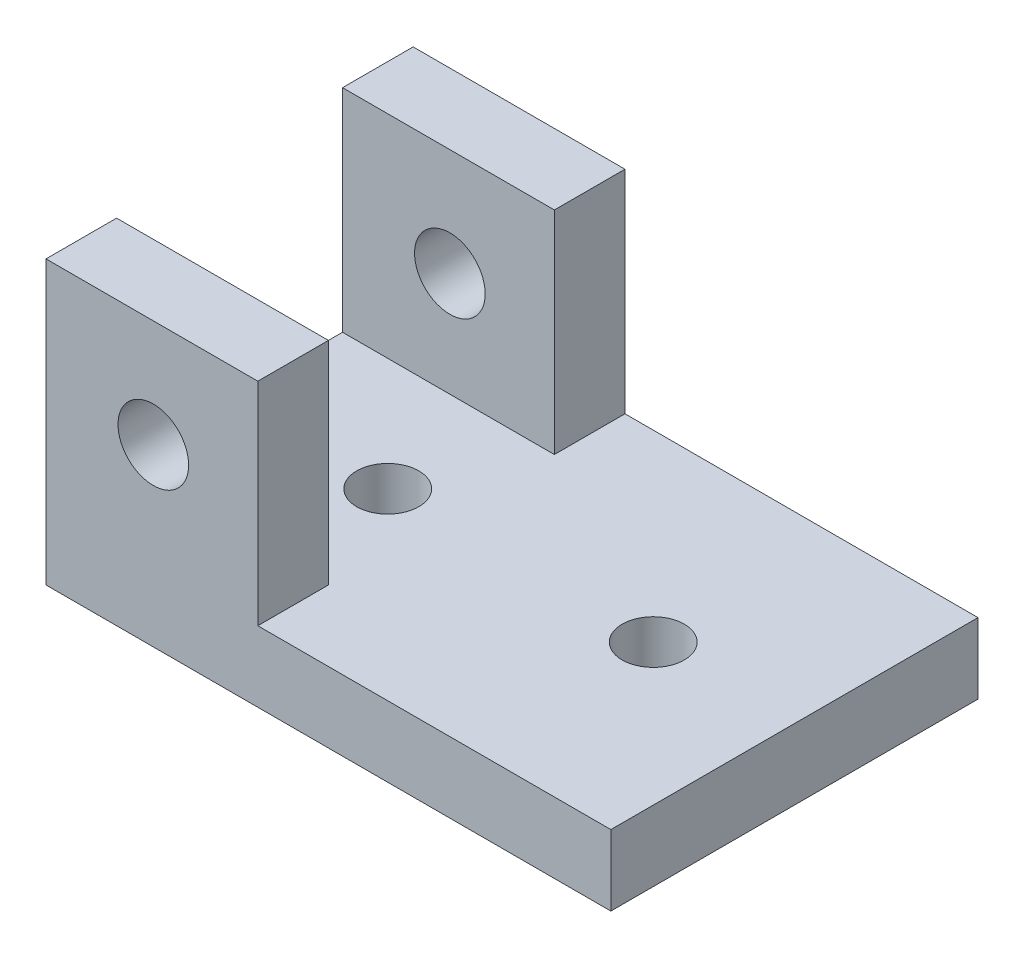
ISO-10303-21;
HEADER;
FILE_DESCRIPTION(('STEP AP214'),'2;1');
FILE_NAME('part.step','',(''),(''),'','','');
FILE_SCHEMA(('AUTOMOTIVE_DESIGN { 1 0 10303 214 1 1 1 1 }'));
ENDSEC;
DATA;
#1=APPLICATION_CONTEXT('core data for automotive mechanical design processes');
#2=APPLICATION_PROTOCOL_DEFINITION('international standard','automotive_design',2000,#1);
#3=PRODUCT_CONTEXT('',#1,'mechanical');
#4=PRODUCT('Part','Part','',(#3));
#5=PRODUCT_RELATED_PRODUCT_CATEGORY('part','',(#4));
#6=PRODUCT_DEFINITION_FORMATION('','',#4);
#7=PRODUCT_DEFINITION_CONTEXT('part definition',#1,'design');
#8=PRODUCT_DEFINITION('design','',#6,#7);
#9=PRODUCT_DEFINITION_SHAPE('','',#8);
#10=(LENGTH_UNIT() NAMED_UNIT(*) SI_UNIT(.MILLI.,.METRE.));
#11=(NAMED_UNIT(*) PLANE_ANGLE_UNIT() SI_UNIT($,.RADIAN.));
#12=(NAMED_UNIT(*) SI_UNIT($,.STERADIAN.) SOLID_ANGLE_UNIT());
#13=UNCERTAINTY_MEASURE_WITH_UNIT(LENGTH_MEASURE(1.E-05),#10,'distance_accuracy_value','');
#14=(GEOMETRIC_REPRESENTATION_CONTEXT(3) GLOBAL_UNCERTAINTY_ASSIGNED_CONTEXT((#13)) GLOBAL_UNIT_ASSIGNED_CONTEXT((#10,
#11,#12)) REPRESENTATION_CONTEXT('',''));
#15=CARTESIAN_POINT('',(0.,0.,0.));
#16=DIRECTION('',(0.,0.,1.));
#17=DIRECTION('',(1.,0.,0.));
#18=AXIS2_PLACEMENT_3D('',#15,#16,#17);
#19=CARTESIAN_POINT('',(0.,6.35,0.));
#20=DIRECTION('',(0.,-1.,0.));
#21=DIRECTION('',(0.,0.,-1.));
#22=AXIS2_PLACEMENT_3D('',#19,#20,#21);
#23=PLANE('',#22);
#24=CARTESIAN_POINT('',(14.224,6.35,-16.51));
#25=DIRECTION('',(0.,1.,0.));
#26=DIRECTION('',(0.,0.,1.));
#27=AXIS2_PLACEMENT_3D('',#24,#25,#26);
#28=CIRCLE('',#27,2.794);
#29=CARTESIAN_POINT('',(14.224,6.35,-13.716));
#30=VERTEX_POINT('',#29);
#31=EDGE_CURVE('E185',#30,#30,#28,.T.);
#32=ORIENTED_EDGE('',*,*,#31,.F.);
#33=EDGE_LOOP('',(#32));
#34=FACE_BOUND('',#33,.T.);
#35=CARTESIAN_POINT('',(38.1,6.35,-16.51));
#36=DIRECTION('',(0.,1.,0.));
#37=DIRECTION('',(0.,0.,1.));
#38=AXIS2_PLACEMENT_3D('',#35,#36,#37);
#39=CIRCLE('',#38,2.794);
#40=CARTESIAN_POINT('',(38.1,6.35,-13.716));
#41=VERTEX_POINT('',#40);
#42=EDGE_CURVE('E181',#41,#41,#39,.T.);
#43=ORIENTED_EDGE('',*,*,#42,.F.);
#44=EDGE_LOOP('',(#43));
#45=FACE_BOUND('',#44,.T.);
#46=DIRECTION('',(0.,0.,1.));
#47=VECTOR('',#46,1.);
#48=CARTESIAN_POINT('',(19.05,6.35,-33.02));
#49=LINE('',#48,#47);
#50=CARTESIAN_POINT('',(19.05,6.35,-33.02));
#51=VERTEX_POINT('',#50);
#52=CARTESIAN_POINT('',(19.05,6.35,-26.67));
#53=VERTEX_POINT('',#52);
#54=EDGE_CURVE('E60',#51,#53,#49,.T.);
#55=ORIENTED_EDGE('',*,*,#54,.T.);
#56=DIRECTION('',(-1.,0.,0.));
#57=VECTOR('',#56,1.);
#58=CARTESIAN_POINT('',(19.05,6.35,-26.67));
#59=LINE('',#58,#57);
#60=CARTESIAN_POINT('',(0.,6.35,-26.67));
#61=VERTEX_POINT('',#60);
#62=EDGE_CURVE('E153',#53,#61,#59,.T.);
#63=ORIENTED_EDGE('',*,*,#62,.T.);
#64=DIRECTION('',(0.,0.,1.));
#65=VECTOR('',#64,1.);
#66=CARTESIAN_POINT('',(0.,6.35,0.));
#67=LINE('',#66,#65);
#68=CARTESIAN_POINT('',(0.,6.35,-6.35));
#69=VERTEX_POINT('',#68);
#70=EDGE_CURVE('E129',#61,#69,#67,.T.);
#71=ORIENTED_EDGE('',*,*,#70,.T.);
#72=DIRECTION('',(-1.,0.,0.));
#73=VECTOR('',#72,1.);
#74=CARTESIAN_POINT('',(19.05,6.35,-6.35));
#75=LINE('',#74,#73);
#76=CARTESIAN_POINT('',(19.05,6.35,-6.35));
#77=VERTEX_POINT('',#76);
#78=EDGE_CURVE('E163',#77,#69,#75,.T.);
#79=ORIENTED_EDGE('',*,*,#78,.F.);
#80=DIRECTION('',(0.,0.,-1.));
#81=VECTOR('',#80,1.);
#82=CARTESIAN_POINT('',(19.05,6.35,0.));
#83=LINE('',#82,#81);
#84=CARTESIAN_POINT('',(19.05,6.35,0.));
#85=VERTEX_POINT('',#84);
#86=EDGE_CURVE('E133',#85,#77,#83,.T.);
#87=ORIENTED_EDGE('',*,*,#86,.F.);
#88=DIRECTION('',(1.,0.,0.));
#89=VECTOR('',#88,1.);
#90=CARTESIAN_POINT('',(50.8,6.35,0.));
#91=LINE('',#90,#89);
#92=CARTESIAN_POINT('',(50.8,6.35,0.));
#93=VERTEX_POINT('',#92);
#94=EDGE_CURVE('E194',#85,#93,#91,.T.);
#95=ORIENTED_EDGE('',*,*,#94,.T.);
#96=DIRECTION('',(0.,0.,-1.));
#97=VECTOR('',#96,1.);
#98=CARTESIAN_POINT('',(50.8,6.35,-33.02));
#99=LINE('',#98,#97);
#100=CARTESIAN_POINT('',(50.8,6.35,-33.02));
#101=VERTEX_POINT('',#100);
#102=EDGE_CURVE('E196',#93,#101,#99,.T.);
#103=ORIENTED_EDGE('',*,*,#102,.T.);
#104=DIRECTION('',(-1.,0.,0.));
#105=VECTOR('',#104,1.);
#106=CARTESIAN_POINT('',(0.,6.35,-33.02));
#107=LINE('',#106,#105);
#108=EDGE_CURVE('E65',#101,#51,#107,.T.);
#109=ORIENTED_EDGE('',*,*,#108,.T.);
#110=EDGE_LOOP('',(#55,#63,#71,#79,#87,#95,#103,#109));
#111=FACE_BOUND('',#110,.T.);
#112=ADVANCED_FACE('F44',(#34,#45,#111),#23,.F.);
#113=CARTESIAN_POINT('',(50.8,6.35,0.));
#114=DIRECTION('',(0.,0.,-1.));
#115=DIRECTION('',(-1.,0.,0.));
#116=AXIS2_PLACEMENT_3D('',#113,#114,#115);
#117=PLANE('',#116);
#118=CARTESIAN_POINT('',(9.652,15.748,0.));
#119=DIRECTION('',(0.,0.,1.));
#120=DIRECTION('',(1.,0.,0.));
#121=AXIS2_PLACEMENT_3D('',#118,#119,#120);
#122=CIRCLE('',#121,3.175);
#123=CARTESIAN_POINT('',(12.827,15.748,0.));
#124=VERTEX_POINT('',#123);
#125=EDGE_CURVE('E387',#124,#124,#122,.T.);
#126=ORIENTED_EDGE('',*,*,#125,.F.);
#127=EDGE_LOOP('',(#126));
#128=FACE_BOUND('',#127,.T.);
#129=DIRECTION('',(1.,0.,0.));
#130=VECTOR('',#129,1.);
#131=CARTESIAN_POINT('',(50.8,0.,0.));
#132=LINE('',#131,#130);
#133=CARTESIAN_POINT('',(0.,0.,0.));
#134=VERTEX_POINT('',#133);
#135=CARTESIAN_POINT('',(50.8,0.,0.));
#136=VERTEX_POINT('',#135);
#137=EDGE_CURVE('E191',#134,#136,#132,.T.);
#138=ORIENTED_EDGE('',*,*,#137,.T.);
#139=DIRECTION('',(0.,-1.,0.));
#140=VECTOR('',#139,1.);
#141=CARTESIAN_POINT('',(50.8,6.35,0.));
#142=LINE('',#141,#140);
#143=EDGE_CURVE('E13',#93,#136,#142,.T.);
#144=ORIENTED_EDGE('',*,*,#143,.F.);
#145=ORIENTED_EDGE('',*,*,#94,.F.);
#146=DIRECTION('',(0.,-1.,0.));
#147=VECTOR('',#146,1.);
#148=CARTESIAN_POINT('',(19.05,25.4,0.));
#149=LINE('',#148,#147);
#150=CARTESIAN_POINT('',(19.05,25.4,0.));
#151=VERTEX_POINT('',#150);
#152=EDGE_CURVE('E178',#151,#85,#149,.T.);
#153=ORIENTED_EDGE('',*,*,#152,.F.);
#154=DIRECTION('',(1.,0.,0.));
#155=VECTOR('',#154,1.);
#156=CARTESIAN_POINT('',(0.,25.4,0.));
#157=LINE('',#156,#155);
#158=CARTESIAN_POINT('',(0.,25.4,0.));
#159=VERTEX_POINT('',#158);
#160=EDGE_CURVE('E162',#159,#151,#157,.T.);
#161=ORIENTED_EDGE('',*,*,#160,.F.);
#162=DIRECTION('',(0.,-1.,0.));
#163=VECTOR('',#162,1.);
#164=CARTESIAN_POINT('',(0.,6.35,0.));
#165=LINE('',#164,#163);
#166=EDGE_CURVE('E201',#159,#134,#165,.T.);
#167=ORIENTED_EDGE('',*,*,#166,.T.);
#168=EDGE_LOOP('',(#138,#144,#145,#153,#161,#167));
#169=FACE_BOUND('',#168,.T.);
#170=ADVANCED_FACE('F46',(#128,#169),#117,.F.);
#171=CARTESIAN_POINT('',(50.8,6.35,-33.02));
#172=DIRECTION('',(-1.,0.,0.));
#173=DIRECTION('',(0.,0.,1.));
#174=AXIS2_PLACEMENT_3D('',#171,#172,#173);
#175=PLANE('',#174);
#176=DIRECTION('',(0.,0.,-1.));
#177=VECTOR('',#176,1.);
#178=CARTESIAN_POINT('',(50.8,0.,-33.02));
#179=LINE('',#178,#177);
#180=CARTESIAN_POINT('',(50.8,0.,-33.02));
#181=VERTEX_POINT('',#180);
#182=EDGE_CURVE('E204',#136,#181,#179,.T.);
#183=ORIENTED_EDGE('',*,*,#182,.T.);
#184=DIRECTION('',(0.,-1.,0.));
#185=VECTOR('',#184,1.);
#186=CARTESIAN_POINT('',(50.8,6.35,-33.02));
#187=LINE('',#186,#185);
#188=EDGE_CURVE('E53',#101,#181,#187,.T.);
#189=ORIENTED_EDGE('',*,*,#188,.F.);
#190=ORIENTED_EDGE('',*,*,#102,.F.);
#191=ORIENTED_EDGE('',*,*,#143,.T.);
#192=EDGE_LOOP('',(#183,#189,#190,#191));
#193=FACE_BOUND('',#192,.T.);
#194=ADVANCED_FACE('F258',(#193),#175,.F.);
#195=CARTESIAN_POINT('',(0.,6.35,-33.02));
#196=DIRECTION('',(0.,0.,1.));
#197=DIRECTION('',(1.,0.,0.));
#198=AXIS2_PLACEMENT_3D('',#195,#196,#197);
#199=PLANE('',#198);
#200=CARTESIAN_POINT('',(9.652,15.748,-33.02));
#201=DIRECTION('',(0.,0.,1.));
#202=DIRECTION('',(1.,0.,0.));
#203=AXIS2_PLACEMENT_3D('',#200,#201,#202);
#204=CIRCLE('',#203,3.175);
#205=CARTESIAN_POINT('',(12.827,15.748,-33.02));
#206=VERTEX_POINT('',#205);
#207=EDGE_CURVE('E155',#206,#206,#204,.T.);
#208=ORIENTED_EDGE('',*,*,#207,.T.);
#209=EDGE_LOOP('',(#208));
#210=FACE_BOUND('',#209,.T.);
#211=DIRECTION('',(-1.,0.,0.));
#212=VECTOR('',#211,1.);
#213=CARTESIAN_POINT('',(0.,0.,-33.02));
#214=LINE('',#213,#212);
#215=CARTESIAN_POINT('',(0.,0.,-33.02));
#216=VERTEX_POINT('',#215);
#217=EDGE_CURVE('E206',#181,#216,#214,.T.);
#218=ORIENTED_EDGE('',*,*,#217,.T.);
#219=DIRECTION('',(0.,-1.,0.));
#220=VECTOR('',#219,1.);
#221=CARTESIAN_POINT('',(0.,6.35,-33.02));
#222=LINE('',#221,#220);
#223=CARTESIAN_POINT('',(0.,25.4,-33.02));
#224=VERTEX_POINT('',#223);
#225=EDGE_CURVE('E211',#224,#216,#222,.T.);
#226=ORIENTED_EDGE('',*,*,#225,.F.);
#227=DIRECTION('',(1.,0.,0.));
#228=VECTOR('',#227,1.);
#229=CARTESIAN_POINT('',(0.,25.4,-33.02));
#230=LINE('',#229,#228);
#231=CARTESIAN_POINT('',(19.05,25.4,-33.02));
#232=VERTEX_POINT('',#231);
#233=EDGE_CURVE('E143',#224,#232,#230,.T.);
#234=ORIENTED_EDGE('',*,*,#233,.T.);
#235=DIRECTION('',(0.,-1.,0.));
#236=VECTOR('',#235,1.);
#237=CARTESIAN_POINT('',(19.05,25.4,-33.02));
#238=LINE('',#237,#236);
#239=EDGE_CURVE('E152',#232,#51,#238,.T.);
#240=ORIENTED_EDGE('',*,*,#239,.T.);
#241=ORIENTED_EDGE('',*,*,#108,.F.);
#242=ORIENTED_EDGE('',*,*,#188,.T.);
#243=EDGE_LOOP('',(#218,#226,#234,#240,#241,#242));
#244=FACE_BOUND('',#243,.T.);
#245=ADVANCED_FACE('F217',(#210,#244),#199,.F.);
#246=CARTESIAN_POINT('',(0.,6.35,0.));
#247=DIRECTION('',(1.,0.,0.));
#248=DIRECTION('',(0.,0.,-1.));
#249=AXIS2_PLACEMENT_3D('',#246,#247,#248);
#250=PLANE('',#249);
#251=DIRECTION('',(0.,0.,1.));
#252=VECTOR('',#251,1.);
#253=CARTESIAN_POINT('',(0.,0.,0.));
#254=LINE('',#253,#252);
#255=EDGE_CURVE('E197',#216,#134,#254,.T.);
#256=ORIENTED_EDGE('',*,*,#255,.T.);
#257=ORIENTED_EDGE('',*,*,#166,.F.);
#258=DIRECTION('',(0.,0.,1.));
#259=VECTOR('',#258,1.);
#260=CARTESIAN_POINT('',(0.,25.4,-6.35));
#261=LINE('',#260,#259);
#262=CARTESIAN_POINT('',(0.,25.4,-6.35));
#263=VERTEX_POINT('',#262);
#264=EDGE_CURVE('E159',#263,#159,#261,.T.);
#265=ORIENTED_EDGE('',*,*,#264,.F.);
#266=DIRECTION('',(0.,-1.,0.));
#267=VECTOR('',#266,1.);
#268=CARTESIAN_POINT('',(0.,25.4,-6.35));
#269=LINE('',#268,#267);
#270=EDGE_CURVE('E169',#263,#69,#269,.T.);
#271=ORIENTED_EDGE('',*,*,#270,.T.);
#272=ORIENTED_EDGE('',*,*,#70,.F.);
#273=DIRECTION('',(0.,-1.,0.));
#274=VECTOR('',#273,1.);
#275=CARTESIAN_POINT('',(0.,25.4,-26.67));
#276=LINE('',#275,#274);
#277=CARTESIAN_POINT('',(0.,25.4,-26.67));
#278=VERTEX_POINT('',#277);
#279=EDGE_CURVE('E122',#278,#61,#276,.T.);
#280=ORIENTED_EDGE('',*,*,#279,.F.);
#281=DIRECTION('',(0.,0.,-1.));
#282=VECTOR('',#281,1.);
#283=CARTESIAN_POINT('',(0.,25.4,-26.67));
#284=LINE('',#283,#282);
#285=EDGE_CURVE('E126',#278,#224,#284,.T.);
#286=ORIENTED_EDGE('',*,*,#285,.T.);
#287=ORIENTED_EDGE('',*,*,#225,.T.);
#288=EDGE_LOOP('',(#256,#257,#265,#271,#272,#280,#286,#287));
#289=FACE_BOUND('',#288,.T.);
#290=ADVANCED_FACE('F124',(#289),#250,.F.);
#291=CARTESIAN_POINT('',(0.,0.,0.));
#292=DIRECTION('',(0.,-1.,0.));
#293=DIRECTION('',(0.,0.,-1.));
#294=AXIS2_PLACEMENT_3D('',#291,#292,#293);
#295=PLANE('',#294);
#296=CARTESIAN_POINT('',(38.1,0.,-16.51));
#297=DIRECTION('',(0.,1.,0.));
#298=DIRECTION('',(0.,0.,1.));
#299=AXIS2_PLACEMENT_3D('',#296,#297,#298);
#300=CIRCLE('',#299,2.794);
#301=CARTESIAN_POINT('',(38.1,0.,-13.716));
#302=VERTEX_POINT('',#301);
#303=EDGE_CURVE('E182',#302,#302,#300,.T.);
#304=ORIENTED_EDGE('',*,*,#303,.T.);
#305=EDGE_LOOP('',(#304));
#306=FACE_BOUND('',#305,.T.);
#307=CARTESIAN_POINT('',(14.224,0.,-16.51));
#308=DIRECTION('',(0.,1.,0.));
#309=DIRECTION('',(0.,0.,1.));
#310=AXIS2_PLACEMENT_3D('',#307,#308,#309);
#311=CIRCLE('',#310,2.794);
#312=CARTESIAN_POINT('',(14.224,0.,-13.716));
#313=VERTEX_POINT('',#312);
#314=EDGE_CURVE('E188',#313,#313,#311,.T.);
#315=ORIENTED_EDGE('',*,*,#314,.T.);
#316=EDGE_LOOP('',(#315));
#317=FACE_BOUND('',#316,.T.);
#318=ORIENTED_EDGE('',*,*,#137,.F.);
#319=ORIENTED_EDGE('',*,*,#255,.F.);
#320=ORIENTED_EDGE('',*,*,#217,.F.);
#321=ORIENTED_EDGE('',*,*,#182,.F.);
#322=EDGE_LOOP('',(#318,#319,#320,#321));
#323=FACE_BOUND('',#322,.T.);
#324=ADVANCED_FACE('F223',(#306,#317,#323),#295,.T.);
#325=CARTESIAN_POINT('',(14.224,0.,-16.51));
#326=DIRECTION('',(0.,1.,0.));
#327=DIRECTION('',(0.,0.,1.));
#328=AXIS2_PLACEMENT_3D('',#325,#326,#327);
#329=CYLINDRICAL_SURFACE('',#328,2.794);
#330=ORIENTED_EDGE('',*,*,#314,.F.);
#331=EDGE_LOOP('',(#330));
#332=FACE_BOUND('',#331,.T.);
#333=ORIENTED_EDGE('',*,*,#31,.T.);
#334=EDGE_LOOP('',(#333));
#335=FACE_BOUND('',#334,.T.);
#336=ADVANCED_FACE('F249',(#332,#335),#329,.F.);
#337=CARTESIAN_POINT('',(38.1,0.,-16.51));
#338=DIRECTION('',(0.,1.,0.));
#339=DIRECTION('',(0.,0.,1.));
#340=AXIS2_PLACEMENT_3D('',#337,#338,#339);
#341=CYLINDRICAL_SURFACE('',#340,2.794);
#342=ORIENTED_EDGE('',*,*,#303,.F.);
#343=EDGE_LOOP('',(#342));
#344=FACE_BOUND('',#343,.T.);
#345=ORIENTED_EDGE('',*,*,#42,.T.);
#346=EDGE_LOOP('',(#345));
#347=FACE_BOUND('',#346,.T.);
#348=ADVANCED_FACE('F241',(#344,#347),#341,.F.);
#349=CARTESIAN_POINT('',(19.05,25.4,0.));
#350=DIRECTION('',(-1.,0.,0.));
#351=DIRECTION('',(0.,0.,1.));
#352=AXIS2_PLACEMENT_3D('',#349,#350,#351);
#353=PLANE('',#352);
#354=ORIENTED_EDGE('',*,*,#86,.T.);
#355=DIRECTION('',(0.,-1.,0.));
#356=VECTOR('',#355,1.);
#357=CARTESIAN_POINT('',(19.05,25.4,-6.35));
#358=LINE('',#357,#356);
#359=CARTESIAN_POINT('',(19.05,25.4,-6.35));
#360=VERTEX_POINT('',#359);
#361=EDGE_CURVE('E175',#360,#77,#358,.T.);
#362=ORIENTED_EDGE('',*,*,#361,.F.);
#363=DIRECTION('',(0.,0.,-1.));
#364=VECTOR('',#363,1.);
#365=CARTESIAN_POINT('',(19.05,25.4,0.));
#366=LINE('',#365,#364);
#367=EDGE_CURVE('E165',#151,#360,#366,.T.);
#368=ORIENTED_EDGE('',*,*,#367,.F.);
#369=ORIENTED_EDGE('',*,*,#152,.T.);
#370=EDGE_LOOP('',(#354,#362,#368,#369));
#371=FACE_BOUND('',#370,.T.);
#372=ADVANCED_FACE('F239',(#371),#353,.F.);
#373=CARTESIAN_POINT('',(19.05,25.4,-6.35));
#374=DIRECTION('',(0.,0.,1.));
#375=DIRECTION('',(1.,0.,0.));
#376=AXIS2_PLACEMENT_3D('',#373,#374,#375);
#377=PLANE('',#376);
#378=CARTESIAN_POINT('',(9.652,15.748,-6.35));
#379=DIRECTION('',(0.,0.,1.));
#380=DIRECTION('',(1.,0.,0.));
#381=AXIS2_PLACEMENT_3D('',#378,#379,#380);
#382=CIRCLE('',#381,3.175);
#383=CARTESIAN_POINT('',(12.827,15.748,-6.35));
#384=VERTEX_POINT('',#383);
#385=EDGE_CURVE('E390',#384,#384,#382,.T.);
#386=ORIENTED_EDGE('',*,*,#385,.T.);
#387=EDGE_LOOP('',(#386));
#388=FACE_BOUND('',#387,.T.);
#389=ORIENTED_EDGE('',*,*,#78,.T.);
#390=ORIENTED_EDGE('',*,*,#270,.F.);
#391=DIRECTION('',(-1.,0.,0.));
#392=VECTOR('',#391,1.);
#393=CARTESIAN_POINT('',(19.05,25.4,-6.35));
#394=LINE('',#393,#392);
#395=EDGE_CURVE('E167',#360,#263,#394,.T.);
#396=ORIENTED_EDGE('',*,*,#395,.F.);
#397=ORIENTED_EDGE('',*,*,#361,.T.);
#398=EDGE_LOOP('',(#389,#390,#396,#397));
#399=FACE_BOUND('',#398,.T.);
#400=ADVANCED_FACE('F236',(#388,#399),#377,.F.);
#401=CARTESIAN_POINT('',(0.,25.4,0.));
#402=DIRECTION('',(0.,1.,0.));
#403=DIRECTION('',(0.,0.,1.));
#404=AXIS2_PLACEMENT_3D('',#401,#402,#403);
#405=PLANE('',#404);
#406=ORIENTED_EDGE('',*,*,#264,.T.);
#407=ORIENTED_EDGE('',*,*,#160,.T.);
#408=ORIENTED_EDGE('',*,*,#367,.T.);
#409=ORIENTED_EDGE('',*,*,#395,.T.);
#410=EDGE_LOOP('',(#406,#407,#408,#409));
#411=FACE_BOUND('',#410,.T.);
#412=ADVANCED_FACE('F232',(#411),#405,.T.);
#413=CARTESIAN_POINT('',(19.05,25.4,-26.67));
#414=DIRECTION('',(0.,0.,1.));
#415=DIRECTION('',(1.,0.,0.));
#416=AXIS2_PLACEMENT_3D('',#413,#414,#415);
#417=PLANE('',#416);
#418=CARTESIAN_POINT('',(9.652,15.748,-26.67));
#419=DIRECTION('',(0.,0.,1.));
#420=DIRECTION('',(1.,0.,0.));
#421=AXIS2_PLACEMENT_3D('',#418,#419,#420);
#422=CIRCLE('',#421,3.175);
#423=CARTESIAN_POINT('',(12.827,15.748,-26.67));
#424=VERTEX_POINT('',#423);
#425=EDGE_CURVE('E48',#424,#424,#422,.T.);
#426=ORIENTED_EDGE('',*,*,#425,.F.);
#427=EDGE_LOOP('',(#426));
#428=FACE_BOUND('',#427,.T.);
#429=ORIENTED_EDGE('',*,*,#62,.F.);
#430=DIRECTION('',(0.,-1.,0.));
#431=VECTOR('',#430,1.);
#432=CARTESIAN_POINT('',(19.05,25.4,-26.67));
#433=LINE('',#432,#431);
#434=CARTESIAN_POINT('',(19.05,25.4,-26.67));
#435=VERTEX_POINT('',#434);
#436=EDGE_CURVE('E134',#435,#53,#433,.T.);
#437=ORIENTED_EDGE('',*,*,#436,.F.);
#438=DIRECTION('',(-1.,0.,0.));
#439=VECTOR('',#438,1.);
#440=CARTESIAN_POINT('',(19.05,25.4,-26.67));
#441=LINE('',#440,#439);
#442=EDGE_CURVE('E140',#435,#278,#441,.T.);
#443=ORIENTED_EDGE('',*,*,#442,.T.);
#444=ORIENTED_EDGE('',*,*,#279,.T.);
#445=EDGE_LOOP('',(#429,#437,#443,#444));
#446=FACE_BOUND('',#445,.T.);
#447=ADVANCED_FACE('F145',(#428,#446),#417,.T.);
#448=CARTESIAN_POINT('',(19.05,25.4,-33.02));
#449=DIRECTION('',(1.,0.,0.));
#450=DIRECTION('',(0.,0.,-1.));
#451=AXIS2_PLACEMENT_3D('',#448,#449,#450);
#452=PLANE('',#451);
#453=ORIENTED_EDGE('',*,*,#54,.F.);
#454=ORIENTED_EDGE('',*,*,#239,.F.);
#455=DIRECTION('',(0.,0.,1.));
#456=VECTOR('',#455,1.);
#457=CARTESIAN_POINT('',(19.05,25.4,-33.02));
#458=LINE('',#457,#456);
#459=EDGE_CURVE('E146',#232,#435,#458,.T.);
#460=ORIENTED_EDGE('',*,*,#459,.T.);
#461=ORIENTED_EDGE('',*,*,#436,.T.);
#462=EDGE_LOOP('',(#453,#454,#460,#461));
#463=FACE_BOUND('',#462,.T.);
#464=ADVANCED_FACE('F346',(#463),#452,.T.);
#465=CARTESIAN_POINT('',(0.,25.4,-33.02));
#466=DIRECTION('',(0.,1.,0.));
#467=DIRECTION('',(0.,0.,-1.));
#468=AXIS2_PLACEMENT_3D('',#465,#466,#467);
#469=PLANE('',#468);
#470=ORIENTED_EDGE('',*,*,#285,.F.);
#471=ORIENTED_EDGE('',*,*,#442,.F.);
#472=ORIENTED_EDGE('',*,*,#459,.F.);
#473=ORIENTED_EDGE('',*,*,#233,.F.);
#474=EDGE_LOOP('',(#470,#471,#472,#473));
#475=FACE_BOUND('',#474,.T.);
#476=ADVANCED_FACE('F138',(#475),#469,.T.);
#477=CARTESIAN_POINT('',(9.652,15.748,-34.29));
#478=DIRECTION('',(0.,0.,1.));
#479=DIRECTION('',(1.,0.,0.));
#480=AXIS2_PLACEMENT_3D('',#477,#478,#479);
#481=CYLINDRICAL_SURFACE('',#480,3.175);
#482=ORIENTED_EDGE('',*,*,#425,.T.);
#483=EDGE_LOOP('',(#482));
#484=FACE_BOUND('',#483,.T.);
#485=ORIENTED_EDGE('',*,*,#207,.F.);
#486=EDGE_LOOP('',(#485));
#487=FACE_BOUND('',#486,.T.);
#488=ADVANCED_FACE('F362',(#484,#487),#481,.F.);
#489=ORIENTED_EDGE('',*,*,#125,.T.);
#490=EDGE_LOOP('',(#489));
#491=FACE_BOUND('',#490,.T.);
#492=ORIENTED_EDGE('',*,*,#385,.F.);
#493=EDGE_LOOP('',(#492));
#494=FACE_BOUND('',#493,.T.);
#495=ADVANCED_FACE('F369',(#491,#494),#481,.F.);
#496=CLOSED_SHELL('',(#112,#170,#194,#245,#290,#324,#336,#348,#372,#400,#412,#447,#464,#476,
#488,#495));
#497=MANIFOLD_SOLID_BREP('B2',#496);
#498=ADVANCED_BREP_SHAPE_REPRESENTATION('',(#18,#497),#14);
#499=SHAPE_DEFINITION_REPRESENTATION(#9,#498);
ENDSEC;
END-ISO-10303-21;
